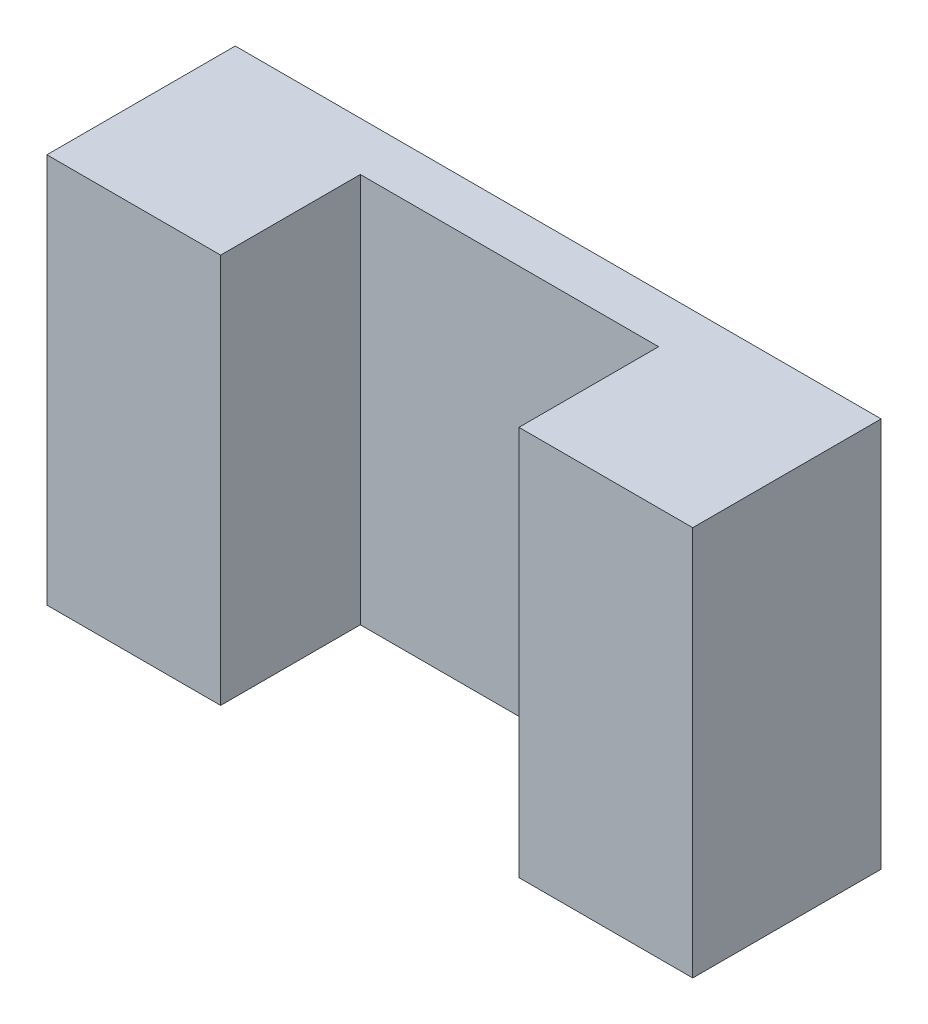
ISO-10303-21;
HEADER;
FILE_DESCRIPTION(('STEP AP214'),'2;1');
FILE_NAME('part.step','',(''),(''),'','','');
FILE_SCHEMA(('AUTOMOTIVE_DESIGN { 1 0 10303 214 1 1 1 1 }'));
ENDSEC;
DATA;
#1=APPLICATION_CONTEXT('core data for automotive mechanical design processes');
#2=APPLICATION_PROTOCOL_DEFINITION('international standard','automotive_design',2000,#1);
#3=PRODUCT_CONTEXT('',#1,'mechanical');
#4=PRODUCT('Part','Part','',(#3));
#5=PRODUCT_RELATED_PRODUCT_CATEGORY('part','',(#4));
#6=PRODUCT_DEFINITION_FORMATION('','',#4);
#7=PRODUCT_DEFINITION_CONTEXT('part definition',#1,'design');
#8=PRODUCT_DEFINITION('design','',#6,#7);
#9=PRODUCT_DEFINITION_SHAPE('','',#8);
#10=(LENGTH_UNIT() NAMED_UNIT(*) SI_UNIT(.MILLI.,.METRE.));
#11=(NAMED_UNIT(*) PLANE_ANGLE_UNIT() SI_UNIT($,.RADIAN.));
#12=(NAMED_UNIT(*) SI_UNIT($,.STERADIAN.) SOLID_ANGLE_UNIT());
#13=UNCERTAINTY_MEASURE_WITH_UNIT(LENGTH_MEASURE(1.E-05),#10,'distance_accuracy_value','');
#14=(GEOMETRIC_REPRESENTATION_CONTEXT(3) GLOBAL_UNCERTAINTY_ASSIGNED_CONTEXT((#13)) GLOBAL_UNIT_ASSIGNED_CONTEXT((#10,
#11,#12)) REPRESENTATION_CONTEXT('',''));
#15=CARTESIAN_POINT('',(0.,0.,0.));
#16=DIRECTION('',(0.,0.,1.));
#17=DIRECTION('',(1.,0.,0.));
#18=AXIS2_PLACEMENT_3D('',#15,#16,#17);
#19=CARTESIAN_POINT('',(-32.99688546,19.925,20.));
#20=DIRECTION('',(1.,0.,0.));
#21=DIRECTION('',(0.,0.,-1.));
#22=AXIS2_PLACEMENT_3D('',#19,#20,#21);
#23=PLANE('',#22);
#24=DIRECTION('',(0.,-1.,0.));
#25=VECTOR('',#24,1.);
#26=CARTESIAN_POINT('',(-32.99688546,19.925,19.25));
#27=LINE('',#26,#25);
#28=CARTESIAN_POINT('',(-32.99688546,19.925,19.25));
#29=VERTEX_POINT('',#28);
#30=CARTESIAN_POINT('',(-32.99688546,-19.925,19.25));
#31=VERTEX_POINT('',#30);
#32=EDGE_CURVE('E95',#29,#31,#27,.T.);
#33=ORIENTED_EDGE('',*,*,#32,.F.);
#34=DIRECTION('',(0.,0.,-1.));
#35=VECTOR('',#34,1.);
#36=CARTESIAN_POINT('',(-32.99688546,19.925,20.));
#37=LINE('',#36,#35);
#38=CARTESIAN_POINT('',(-32.99688546,19.925,0.));
#39=VERTEX_POINT('',#38);
#40=EDGE_CURVE('E121',#29,#39,#37,.T.);
#41=ORIENTED_EDGE('',*,*,#40,.T.);
#42=DIRECTION('',(0.,-1.,0.));
#43=VECTOR('',#42,1.);
#44=CARTESIAN_POINT('',(-32.99688546,19.925,0.));
#45=LINE('',#44,#43);
#46=CARTESIAN_POINT('',(-32.99688546,-19.925,0.));
#47=VERTEX_POINT('',#46);
#48=EDGE_CURVE('E115',#39,#47,#45,.T.);
#49=ORIENTED_EDGE('',*,*,#48,.T.);
#50=DIRECTION('',(0.,0.,-1.));
#51=VECTOR('',#50,1.);
#52=CARTESIAN_POINT('',(-32.99688546,-19.925,20.));
#53=LINE('',#52,#51);
#54=EDGE_CURVE('E41',#31,#47,#53,.T.);
#55=ORIENTED_EDGE('',*,*,#54,.F.);
#56=EDGE_LOOP('',(#33,#41,#49,#55));
#57=FACE_BOUND('',#56,.T.);
#58=ADVANCED_FACE('F34',(#57),#23,.F.);
#59=CARTESIAN_POINT('',(32.99688546,-19.925,20.));
#60=DIRECTION('',(0.,1.,0.));
#61=DIRECTION('',(-1.,0.,0.));
#62=AXIS2_PLACEMENT_3D('',#59,#60,#61);
#63=PLANE('',#62);
#64=DIRECTION('',(1.,0.,0.));
#65=VECTOR('',#64,1.);
#66=CARTESIAN_POINT('',(-32.99688546,-19.925,19.25));
#67=LINE('',#66,#65);
#68=CARTESIAN_POINT('',(-15.24,-19.925,19.25));
#69=VERTEX_POINT('',#68);
#70=EDGE_CURVE('E48',#31,#69,#67,.T.);
#71=ORIENTED_EDGE('',*,*,#70,.F.);
#72=ORIENTED_EDGE('',*,*,#54,.T.);
#73=DIRECTION('',(1.,0.,0.));
#74=VECTOR('',#73,1.);
#75=CARTESIAN_POINT('',(32.99688546,-19.925,0.));
#76=LINE('',#75,#74);
#77=CARTESIAN_POINT('',(32.99688546,-19.925,0.));
#78=VERTEX_POINT('',#77);
#79=EDGE_CURVE('E129',#47,#78,#76,.T.);
#80=ORIENTED_EDGE('',*,*,#79,.T.);
#81=DIRECTION('',(0.,0.,-1.));
#82=VECTOR('',#81,1.);
#83=CARTESIAN_POINT('',(32.99688546,-19.925,20.));
#84=LINE('',#83,#82);
#85=CARTESIAN_POINT('',(32.99688546,-19.925,19.25));
#86=VERTEX_POINT('',#85);
#87=EDGE_CURVE('E116',#86,#78,#84,.T.);
#88=ORIENTED_EDGE('',*,*,#87,.F.);
#89=CARTESIAN_POINT('',(15.24,-19.925,19.25));
#90=VERTEX_POINT('',#89);
#91=EDGE_CURVE('E102',#90,#86,#67,.T.);
#92=ORIENTED_EDGE('',*,*,#91,.F.);
#93=DIRECTION('',(0.,0.,1.));
#94=VECTOR('',#93,1.);
#95=CARTESIAN_POINT('',(15.24,-19.925,4.98));
#96=LINE('',#95,#94);
#97=CARTESIAN_POINT('',(15.24,-19.925,4.98));
#98=VERTEX_POINT('',#97);
#99=EDGE_CURVE('E134',#98,#90,#96,.T.);
#100=ORIENTED_EDGE('',*,*,#99,.F.);
#101=DIRECTION('',(1.,0.,0.));
#102=VECTOR('',#101,1.);
#103=CARTESIAN_POINT('',(15.24,-19.925,4.98));
#104=LINE('',#103,#102);
#105=CARTESIAN_POINT('',(-15.24,-19.925,4.98));
#106=VERTEX_POINT('',#105);
#107=EDGE_CURVE('E148',#106,#98,#104,.T.);
#108=ORIENTED_EDGE('',*,*,#107,.F.);
#109=DIRECTION('',(0.,0.,1.));
#110=VECTOR('',#109,1.);
#111=CARTESIAN_POINT('',(-15.24,-19.925,4.98));
#112=LINE('',#111,#110);
#113=EDGE_CURVE('E110',#106,#69,#112,.T.);
#114=ORIENTED_EDGE('',*,*,#113,.T.);
#115=EDGE_LOOP('',(#71,#72,#80,#88,#92,#100,#108,#114));
#116=FACE_BOUND('',#115,.T.);
#117=ADVANCED_FACE('F106',(#116),#63,.F.);
#118=CARTESIAN_POINT('',(32.99688546,19.925,20.));
#119=DIRECTION('',(-1.,0.,0.));
#120=DIRECTION('',(0.,-1.,0.));
#121=AXIS2_PLACEMENT_3D('',#118,#119,#120);
#122=PLANE('',#121);
#123=DIRECTION('',(0.,1.,0.));
#124=VECTOR('',#123,1.);
#125=CARTESIAN_POINT('',(32.99688546,19.925,19.25));
#126=LINE('',#125,#124);
#127=CARTESIAN_POINT('',(32.99688546,19.925,19.25));
#128=VERTEX_POINT('',#127);
#129=EDGE_CURVE('E111',#86,#128,#126,.T.);
#130=ORIENTED_EDGE('',*,*,#129,.F.);
#131=ORIENTED_EDGE('',*,*,#87,.T.);
#132=DIRECTION('',(0.,1.,0.));
#133=VECTOR('',#132,1.);
#134=CARTESIAN_POINT('',(32.99688546,19.925,0.));
#135=LINE('',#134,#133);
#136=CARTESIAN_POINT('',(32.99688546,19.925,0.));
#137=VERTEX_POINT('',#136);
#138=EDGE_CURVE('E126',#78,#137,#135,.T.);
#139=ORIENTED_EDGE('',*,*,#138,.T.);
#140=DIRECTION('',(0.,0.,-1.));
#141=VECTOR('',#140,1.);
#142=CARTESIAN_POINT('',(32.99688546,19.925,20.));
#143=LINE('',#142,#141);
#144=EDGE_CURVE('E117',#128,#137,#143,.T.);
#145=ORIENTED_EDGE('',*,*,#144,.F.);
#146=EDGE_LOOP('',(#130,#131,#139,#145));
#147=FACE_BOUND('',#146,.T.);
#148=ADVANCED_FACE('F166',(#147),#122,.F.);
#149=CARTESIAN_POINT('',(32.99688546,19.925,20.));
#150=DIRECTION('',(0.,-1.,0.));
#151=DIRECTION('',(1.,0.,0.));
#152=AXIS2_PLACEMENT_3D('',#149,#150,#151);
#153=PLANE('',#152);
#154=DIRECTION('',(-1.,0.,0.));
#155=VECTOR('',#154,1.);
#156=CARTESIAN_POINT('',(-32.99688546,19.925,19.25));
#157=LINE('',#156,#155);
#158=CARTESIAN_POINT('',(15.24,19.925,19.25));
#159=VERTEX_POINT('',#158);
#160=EDGE_CURVE('E55',#128,#159,#157,.T.);
#161=ORIENTED_EDGE('',*,*,#160,.F.);
#162=ORIENTED_EDGE('',*,*,#144,.T.);
#163=DIRECTION('',(-1.,0.,0.));
#164=VECTOR('',#163,1.);
#165=CARTESIAN_POINT('',(32.99688546,19.925,0.));
#166=LINE('',#165,#164);
#167=EDGE_CURVE('E123',#137,#39,#166,.T.);
#168=ORIENTED_EDGE('',*,*,#167,.T.);
#169=ORIENTED_EDGE('',*,*,#40,.F.);
#170=CARTESIAN_POINT('',(-15.24,19.925,19.25));
#171=VERTEX_POINT('',#170);
#172=EDGE_CURVE('E98',#171,#29,#157,.T.);
#173=ORIENTED_EDGE('',*,*,#172,.F.);
#174=DIRECTION('',(0.,0.,1.));
#175=VECTOR('',#174,1.);
#176=CARTESIAN_POINT('',(-15.24,19.925,4.98));
#177=LINE('',#176,#175);
#178=CARTESIAN_POINT('',(-15.24,19.925,4.98));
#179=VERTEX_POINT('',#178);
#180=EDGE_CURVE('E132',#179,#171,#177,.T.);
#181=ORIENTED_EDGE('',*,*,#180,.F.);
#182=DIRECTION('',(-1.,0.,0.));
#183=VECTOR('',#182,1.);
#184=CARTESIAN_POINT('',(15.24,19.925,4.98));
#185=LINE('',#184,#183);
#186=CARTESIAN_POINT('',(15.24,19.925,4.98));
#187=VERTEX_POINT('',#186);
#188=EDGE_CURVE('E135',#187,#179,#185,.T.);
#189=ORIENTED_EDGE('',*,*,#188,.F.);
#190=DIRECTION('',(0.,0.,1.));
#191=VECTOR('',#190,1.);
#192=CARTESIAN_POINT('',(15.24,19.925,4.98));
#193=LINE('',#192,#191);
#194=EDGE_CURVE('E138',#187,#159,#193,.T.);
#195=ORIENTED_EDGE('',*,*,#194,.T.);
#196=EDGE_LOOP('',(#161,#162,#168,#169,#173,#181,#189,#195));
#197=FACE_BOUND('',#196,.T.);
#198=ADVANCED_FACE('F164',(#197),#153,.F.);
#199=CARTESIAN_POINT('',(-15.24,19.925,4.98));
#200=DIRECTION('',(-1.,0.,0.));
#201=DIRECTION('',(0.,0.,1.));
#202=AXIS2_PLACEMENT_3D('',#199,#200,#201);
#203=PLANE('',#202);
#204=DIRECTION('',(0.,1.,0.));
#205=VECTOR('',#204,1.);
#206=CARTESIAN_POINT('',(-15.24,19.925,19.25));
#207=LINE('',#206,#205);
#208=EDGE_CURVE('E154',#69,#171,#207,.T.);
#209=ORIENTED_EDGE('',*,*,#208,.F.);
#210=ORIENTED_EDGE('',*,*,#113,.F.);
#211=DIRECTION('',(0.,-1.,0.));
#212=VECTOR('',#211,1.);
#213=CARTESIAN_POINT('',(-15.24,19.925,4.98));
#214=LINE('',#213,#212);
#215=EDGE_CURVE('E151',#179,#106,#214,.T.);
#216=ORIENTED_EDGE('',*,*,#215,.F.);
#217=ORIENTED_EDGE('',*,*,#180,.T.);
#218=EDGE_LOOP('',(#209,#210,#216,#217));
#219=FACE_BOUND('',#218,.T.);
#220=ADVANCED_FACE('F173',(#219),#203,.F.);
#221=CARTESIAN_POINT('',(15.24,19.925,4.98));
#222=DIRECTION('',(1.,0.,0.));
#223=DIRECTION('',(0.,0.,-1.));
#224=AXIS2_PLACEMENT_3D('',#221,#222,#223);
#225=PLANE('',#224);
#226=DIRECTION('',(0.,-1.,0.));
#227=VECTOR('',#226,1.);
#228=CARTESIAN_POINT('',(15.24,19.925,19.25));
#229=LINE('',#228,#227);
#230=EDGE_CURVE('E11',#159,#90,#229,.T.);
#231=ORIENTED_EDGE('',*,*,#230,.F.);
#232=ORIENTED_EDGE('',*,*,#194,.F.);
#233=DIRECTION('',(0.,1.,0.));
#234=VECTOR('',#233,1.);
#235=CARTESIAN_POINT('',(15.24,19.925,4.98));
#236=LINE('',#235,#234);
#237=EDGE_CURVE('E145',#98,#187,#236,.T.);
#238=ORIENTED_EDGE('',*,*,#237,.F.);
#239=ORIENTED_EDGE('',*,*,#99,.T.);
#240=EDGE_LOOP('',(#231,#232,#238,#239));
#241=FACE_BOUND('',#240,.T.);
#242=ADVANCED_FACE('F178',(#241),#225,.F.);
#243=CARTESIAN_POINT('',(0.,0.,0.));
#244=DIRECTION('',(0.,0.,-1.));
#245=DIRECTION('',(-1.,0.,0.));
#246=AXIS2_PLACEMENT_3D('',#243,#244,#245);
#247=PLANE('',#246);
#248=ORIENTED_EDGE('',*,*,#48,.F.);
#249=ORIENTED_EDGE('',*,*,#167,.F.);
#250=ORIENTED_EDGE('',*,*,#138,.F.);
#251=ORIENTED_EDGE('',*,*,#79,.F.);
#252=EDGE_LOOP('',(#248,#249,#250,#251));
#253=FACE_BOUND('',#252,.T.);
#254=ADVANCED_FACE('F170',(#253),#247,.T.);
#255=CARTESIAN_POINT('',(0.,0.,4.98));
#256=DIRECTION('',(0.,0.,-1.));
#257=DIRECTION('',(-1.,0.,0.));
#258=AXIS2_PLACEMENT_3D('',#255,#256,#257);
#259=PLANE('',#258);
#260=ORIENTED_EDGE('',*,*,#215,.T.);
#261=ORIENTED_EDGE('',*,*,#107,.T.);
#262=ORIENTED_EDGE('',*,*,#237,.T.);
#263=ORIENTED_EDGE('',*,*,#188,.T.);
#264=EDGE_LOOP('',(#260,#261,#262,#263));
#265=FACE_BOUND('',#264,.T.);
#266=ADVANCED_FACE('F175',(#265),#259,.F.);
#267=CARTESIAN_POINT('',(0.,0.,19.25));
#268=DIRECTION('',(0.,0.,1.));
#269=DIRECTION('',(1.,0.,0.));
#270=AXIS2_PLACEMENT_3D('',#267,#268,#269);
#271=PLANE('',#270);
#272=ORIENTED_EDGE('',*,*,#230,.T.);
#273=ORIENTED_EDGE('',*,*,#91,.T.);
#274=ORIENTED_EDGE('',*,*,#129,.T.);
#275=ORIENTED_EDGE('',*,*,#160,.T.);
#276=EDGE_LOOP('',(#272,#273,#274,#275));
#277=FACE_BOUND('',#276,.T.);
#278=ADVANCED_FACE('F158',(#277),#271,.T.);
#279=ORIENTED_EDGE('',*,*,#208,.T.);
#280=ORIENTED_EDGE('',*,*,#172,.T.);
#281=ORIENTED_EDGE('',*,*,#32,.T.);
#282=ORIENTED_EDGE('',*,*,#70,.T.);
#283=EDGE_LOOP('',(#279,#280,#281,#282));
#284=FACE_BOUND('',#283,.T.);
#285=ADVANCED_FACE('F96',(#284),#271,.T.);
#286=CLOSED_SHELL('',(#58,#117,#148,#198,#220,#242,#254,#266,#278,#285));
#287=MANIFOLD_SOLID_BREP('B2',#286);
#288=ADVANCED_BREP_SHAPE_REPRESENTATION('',(#18,#287),#14);
#289=SHAPE_DEFINITION_REPRESENTATION(#9,#288);
ENDSEC;
END-ISO-10303-21;
